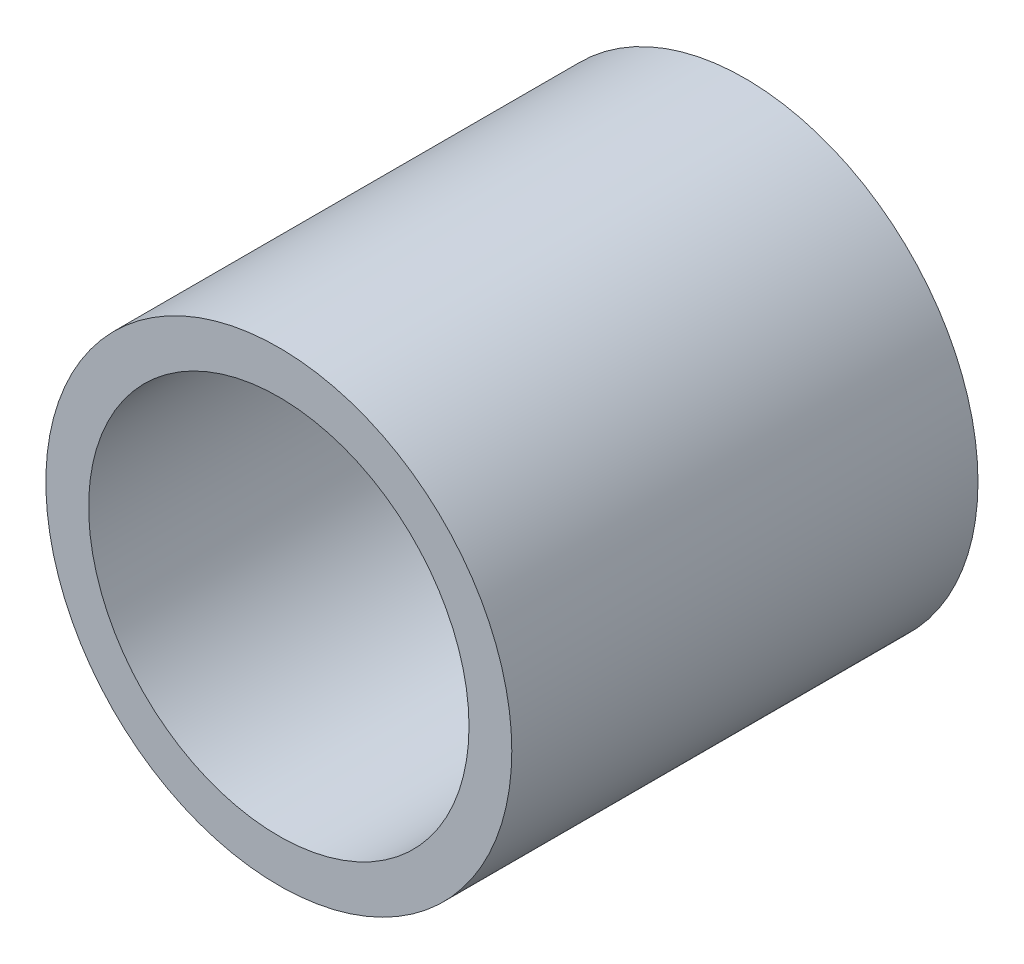
ISO-10303-21;
HEADER;
FILE_DESCRIPTION(('STEP AP214'),'2;1');
FILE_NAME('part.step','',(''),(''),'','','');
FILE_SCHEMA(('AUTOMOTIVE_DESIGN { 1 0 10303 214 1 1 1 1 }'));
ENDSEC;
DATA;
#1=APPLICATION_CONTEXT('core data for automotive mechanical design processes');
#2=APPLICATION_PROTOCOL_DEFINITION('international standard','automotive_design',2000,#1);
#3=PRODUCT_CONTEXT('',#1,'mechanical');
#4=PRODUCT('Part','Part','',(#3));
#5=PRODUCT_RELATED_PRODUCT_CATEGORY('part','',(#4));
#6=PRODUCT_DEFINITION_FORMATION('','',#4);
#7=PRODUCT_DEFINITION_CONTEXT('part definition',#1,'design');
#8=PRODUCT_DEFINITION('design','',#6,#7);
#9=PRODUCT_DEFINITION_SHAPE('','',#8);
#10=(LENGTH_UNIT() NAMED_UNIT(*) SI_UNIT(.MILLI.,.METRE.));
#11=(NAMED_UNIT(*) PLANE_ANGLE_UNIT() SI_UNIT($,.RADIAN.));
#12=(NAMED_UNIT(*) SI_UNIT($,.STERADIAN.) SOLID_ANGLE_UNIT());
#13=UNCERTAINTY_MEASURE_WITH_UNIT(LENGTH_MEASURE(1.E-05),#10,'distance_accuracy_value','');
#14=(GEOMETRIC_REPRESENTATION_CONTEXT(3) GLOBAL_UNCERTAINTY_ASSIGNED_CONTEXT((#13)) GLOBAL_UNIT_ASSIGNED_CONTEXT((#10,
#11,#12)) REPRESENTATION_CONTEXT('',''));
#15=CARTESIAN_POINT('',(0.,0.,0.));
#16=DIRECTION('',(0.,0.,1.));
#17=DIRECTION('',(1.,0.,0.));
#18=AXIS2_PLACEMENT_3D('',#15,#16,#17);
#19=CARTESIAN_POINT('',(0.,0.,10.05));
#20=DIRECTION('',(0.,0.,1.));
#21=DIRECTION('',(1.,0.,0.));
#22=AXIS2_PLACEMENT_3D('',#19,#20,#21);
#23=PLANE('',#22);
#24=CARTESIAN_POINT('',(0.,0.,10.05));
#25=DIRECTION('',(0.,0.,1.));
#26=DIRECTION('',(1.,0.,0.));
#27=AXIS2_PLACEMENT_3D('',#24,#25,#26);
#28=CIRCLE('',#27,5.0225);
#29=CARTESIAN_POINT('',(5.0225,0.,10.05));
#30=VERTEX_POINT('',#29);
#31=EDGE_CURVE('E10',#30,#30,#28,.T.);
#32=ORIENTED_EDGE('',*,*,#31,.T.);
#33=EDGE_LOOP('',(#32));
#34=FACE_BOUND('',#33,.T.);
#35=CARTESIAN_POINT('',(0.,0.,10.05));
#36=DIRECTION('',(0.,0.,1.));
#37=DIRECTION('',(1.,0.,0.));
#38=AXIS2_PLACEMENT_3D('',#35,#36,#37);
#39=CIRCLE('',#38,4.1);
#40=CARTESIAN_POINT('',(4.1,0.,10.05));
#41=VERTEX_POINT('',#40);
#42=EDGE_CURVE('E50',#41,#41,#39,.T.);
#43=ORIENTED_EDGE('',*,*,#42,.F.);
#44=EDGE_LOOP('',(#43));
#45=FACE_BOUND('',#44,.T.);
#46=ADVANCED_FACE('F37',(#34,#45),#23,.T.);
#47=CARTESIAN_POINT('',(0.,0.,0.));
#48=DIRECTION('',(0.,0.,1.));
#49=DIRECTION('',(1.,0.,0.));
#50=AXIS2_PLACEMENT_3D('',#47,#48,#49);
#51=PLANE('',#50);
#52=CARTESIAN_POINT('',(0.,0.,0.));
#53=DIRECTION('',(0.,0.,1.));
#54=DIRECTION('',(1.,0.,0.));
#55=AXIS2_PLACEMENT_3D('',#52,#53,#54);
#56=CIRCLE('',#55,5.0225);
#57=CARTESIAN_POINT('',(5.0225,0.,0.));
#58=VERTEX_POINT('',#57);
#59=EDGE_CURVE('E41',#58,#58,#56,.T.);
#60=ORIENTED_EDGE('',*,*,#59,.F.);
#61=EDGE_LOOP('',(#60));
#62=FACE_BOUND('',#61,.T.);
#63=CARTESIAN_POINT('',(0.,0.,0.));
#64=DIRECTION('',(0.,0.,1.));
#65=DIRECTION('',(1.,0.,0.));
#66=AXIS2_PLACEMENT_3D('',#63,#64,#65);
#67=CIRCLE('',#66,4.1);
#68=CARTESIAN_POINT('',(4.1,0.,0.));
#69=VERTEX_POINT('',#68);
#70=EDGE_CURVE('E52',#69,#69,#67,.T.);
#71=ORIENTED_EDGE('',*,*,#70,.T.);
#72=EDGE_LOOP('',(#71));
#73=FACE_BOUND('',#72,.T.);
#74=ADVANCED_FACE('F64',(#62,#73),#51,.F.);
#75=CARTESIAN_POINT('',(0.,0.,10.05));
#76=DIRECTION('',(0.,0.,-1.));
#77=DIRECTION('',(-1.,0.,0.));
#78=AXIS2_PLACEMENT_3D('',#75,#76,#77);
#79=CYLINDRICAL_SURFACE('',#78,5.0225);
#80=ORIENTED_EDGE('',*,*,#31,.F.);
#81=EDGE_LOOP('',(#80));
#82=FACE_BOUND('',#81,.T.);
#83=ORIENTED_EDGE('',*,*,#59,.T.);
#84=EDGE_LOOP('',(#83));
#85=FACE_BOUND('',#84,.T.);
#86=ADVANCED_FACE('F39',(#82,#85),#79,.T.);
#87=CARTESIAN_POINT('',(0.,0.,10.05));
#88=DIRECTION('',(0.,0.,-1.));
#89=DIRECTION('',(-1.,0.,0.));
#90=AXIS2_PLACEMENT_3D('',#87,#88,#89);
#91=CYLINDRICAL_SURFACE('',#90,4.1);
#92=ORIENTED_EDGE('',*,*,#42,.T.);
#93=EDGE_LOOP('',(#92));
#94=FACE_BOUND('',#93,.T.);
#95=ORIENTED_EDGE('',*,*,#70,.F.);
#96=EDGE_LOOP('',(#95));
#97=FACE_BOUND('',#96,.T.);
#98=ADVANCED_FACE('F60',(#94,#97),#91,.F.);
#99=CLOSED_SHELL('',(#46,#74,#86,#98));
#100=MANIFOLD_SOLID_BREP('B2',#99);
#101=ADVANCED_BREP_SHAPE_REPRESENTATION('',(#18,#100),#14);
#102=SHAPE_DEFINITION_REPRESENTATION(#9,#101);
ENDSEC;
END-ISO-10303-21;
